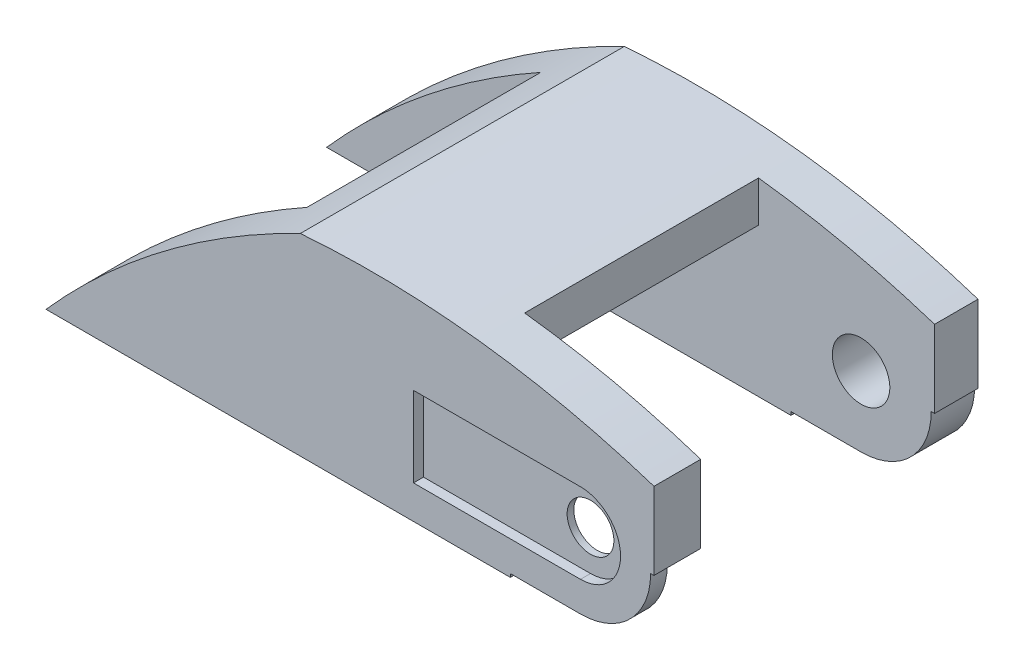
ISO-10303-21;
HEADER;
FILE_DESCRIPTION(('STEP AP214'),'2;1');
FILE_NAME('part.step','',(''),(''),'','','');
FILE_SCHEMA(('AUTOMOTIVE_DESIGN { 1 0 10303 214 1 1 1 1 }'));
ENDSEC;
DATA;
#1=APPLICATION_CONTEXT('core data for automotive mechanical design processes');
#2=APPLICATION_PROTOCOL_DEFINITION('international standard','automotive_design',2000,#1);
#3=PRODUCT_CONTEXT('',#1,'mechanical');
#4=PRODUCT('Part','Part','',(#3));
#5=PRODUCT_RELATED_PRODUCT_CATEGORY('part','',(#4));
#6=PRODUCT_DEFINITION_FORMATION('','',#4);
#7=PRODUCT_DEFINITION_CONTEXT('part definition',#1,'design');
#8=PRODUCT_DEFINITION('design','',#6,#7);
#9=PRODUCT_DEFINITION_SHAPE('','',#8);
#10=(LENGTH_UNIT() NAMED_UNIT(*) SI_UNIT(.MILLI.,.METRE.));
#11=(NAMED_UNIT(*) PLANE_ANGLE_UNIT() SI_UNIT($,.RADIAN.));
#12=(NAMED_UNIT(*) SI_UNIT($,.STERADIAN.) SOLID_ANGLE_UNIT());
#13=UNCERTAINTY_MEASURE_WITH_UNIT(LENGTH_MEASURE(1.E-05),#10,'distance_accuracy_value','');
#14=(GEOMETRIC_REPRESENTATION_CONTEXT(3) GLOBAL_UNCERTAINTY_ASSIGNED_CONTEXT((#13)) GLOBAL_UNIT_ASSIGNED_CONTEXT((#10,
#11,#12)) REPRESENTATION_CONTEXT('',''));
#15=CARTESIAN_POINT('',(0.,0.,0.));
#16=DIRECTION('',(0.,0.,1.));
#17=DIRECTION('',(1.,0.,0.));
#18=AXIS2_PLACEMENT_3D('',#15,#16,#17);
#19=CARTESIAN_POINT('',(0.,0.,-118.7));
#20=DIRECTION('',(0.,0.,1.));
#21=DIRECTION('',(-1.,0.,0.));
#22=AXIS2_PLACEMENT_3D('',#19,#20,#21);
#23=CYLINDRICAL_SURFACE('',#22,3.5);
#24=CARTESIAN_POINT('',(0.,0.,-99.5));
#25=DIRECTION('',(0.,0.,1.));
#26=DIRECTION('',(0.,-1.,0.));
#27=AXIS2_PLACEMENT_3D('',#24,#25,#26);
#28=CIRCLE('',#27,3.5);
#29=CARTESIAN_POINT('',(0.,-3.5,-99.5));
#30=VERTEX_POINT('',#29);
#31=EDGE_CURVE('E53',#30,#30,#28,.T.);
#32=ORIENTED_EDGE('',*,*,#31,.F.);
#33=EDGE_LOOP('',(#32));
#34=FACE_BOUND('',#33,.T.);
#35=CARTESIAN_POINT('',(0.,0.,-98.5));
#36=DIRECTION('',(0.,0.,-1.));
#37=DIRECTION('',(-1.,0.,0.));
#38=AXIS2_PLACEMENT_3D('',#35,#36,#37);
#39=CIRCLE('',#38,3.5);
#40=CARTESIAN_POINT('',(-3.5,0.,-98.5));
#41=VERTEX_POINT('',#40);
#42=EDGE_CURVE('E245',#41,#41,#39,.F.);
#43=ORIENTED_EDGE('',*,*,#42,.T.);
#44=EDGE_LOOP('',(#43));
#45=FACE_BOUND('',#44,.T.);
#46=ADVANCED_FACE('F49',(#34,#45),#23,.F.);
#47=CARTESIAN_POINT('',(0.,-11.,-104.));
#48=DIRECTION('',(0.,1.,0.));
#49=DIRECTION('',(-1.,0.,0.));
#50=AXIS2_PLACEMENT_3D('',#47,#48,#49);
#51=PLANE('',#50);
#52=DIRECTION('',(0.,0.,1.));
#53=VECTOR('',#52,1.);
#54=CARTESIAN_POINT('',(-10.5,-11.,-145.5));
#55=LINE('',#54,#53);
#56=CARTESIAN_POINT('',(-10.5,-11.,-145.5));
#57=VERTEX_POINT('',#56);
#58=CARTESIAN_POINT('',(-10.5,-11.,-139.));
#59=VERTEX_POINT('',#58);
#60=EDGE_CURVE('E353',#57,#59,#55,.T.);
#61=ORIENTED_EDGE('',*,*,#60,.T.);
#62=DIRECTION('',(1.,0.,0.));
#63=VECTOR('',#62,1.);
#64=CARTESIAN_POINT('',(0.,-11.,-139.));
#65=LINE('',#64,#63);
#66=CARTESIAN_POINT('',(-80.,-11.,-139.));
#67=VERTEX_POINT('',#66);
#68=EDGE_CURVE('E443',#67,#59,#65,.T.);
#69=ORIENTED_EDGE('',*,*,#68,.F.);
#70=DIRECTION('',(0.,0.,1.));
#71=VECTOR('',#70,1.);
#72=CARTESIAN_POINT('',(-80.,-11.,-104.));
#73=LINE('',#72,#71);
#74=CARTESIAN_POINT('',(-80.,-11.,-145.5));
#75=VERTEX_POINT('',#74);
#76=EDGE_CURVE('E468',#75,#67,#73,.T.);
#77=ORIENTED_EDGE('',*,*,#76,.F.);
#78=DIRECTION('',(-1.,0.,0.));
#79=VECTOR('',#78,1.);
#80=CARTESIAN_POINT('',(0.,-11.,-145.5));
#81=LINE('',#80,#79);
#82=EDGE_CURVE('E451',#57,#75,#81,.T.);
#83=ORIENTED_EDGE('',*,*,#82,.F.);
#84=EDGE_LOOP('',(#61,#69,#77,#83));
#85=FACE_BOUND('',#84,.T.);
#86=ADVANCED_FACE('F534',(#85),#51,.F.);
#87=CARTESIAN_POINT('',(12.,-12.,-104.));
#88=DIRECTION('',(0.,0.,1.));
#89=DIRECTION('',(0.,-1.,0.));
#90=AXIS2_PLACEMENT_3D('',#87,#88,#89);
#91=PLANE('',#90);
#92=CARTESIAN_POINT('',(0.,0.,-104.));
#93=DIRECTION('',(0.,0.,-1.));
#94=DIRECTION('',(0.,1.,0.));
#95=AXIS2_PLACEMENT_3D('',#92,#93,#94);
#96=CIRCLE('',#95,9.5);
#97=CARTESIAN_POINT('',(-9.5,0.,-104.));
#98=VERTEX_POINT('',#97);
#99=CARTESIAN_POINT('',(9.5,0.,-104.));
#100=VERTEX_POINT('',#99);
#101=EDGE_CURVE('E489',#98,#100,#96,.T.);
#102=ORIENTED_EDGE('',*,*,#101,.F.);
#103=DIRECTION('',(0.,1.,0.));
#104=VECTOR('',#103,1.);
#105=CARTESIAN_POINT('',(-9.5,-12.,-104.));
#106=LINE('',#105,#104);
#107=CARTESIAN_POINT('',(-9.5,-10.5,-104.));
#108=VERTEX_POINT('',#107);
#109=EDGE_CURVE('E305',#108,#98,#106,.T.);
#110=ORIENTED_EDGE('',*,*,#109,.F.);
#111=DIRECTION('',(-1.,0.,0.));
#112=VECTOR('',#111,1.);
#113=CARTESIAN_POINT('',(12.,-10.5,-104.));
#114=LINE('',#113,#112);
#115=CARTESIAN_POINT('',(-10.5,-10.5,-104.));
#116=VERTEX_POINT('',#115);
#117=EDGE_CURVE('E374',#108,#116,#114,.T.);
#118=ORIENTED_EDGE('',*,*,#117,.T.);
#119=DIRECTION('',(0.,-1.,0.));
#120=VECTOR('',#119,1.);
#121=CARTESIAN_POINT('',(-10.5,-12.,-104.));
#122=LINE('',#121,#120);
#123=CARTESIAN_POINT('',(-10.5,-11.,-104.));
#124=VERTEX_POINT('',#123);
#125=EDGE_CURVE('E362',#116,#124,#122,.T.);
#126=ORIENTED_EDGE('',*,*,#125,.T.);
#127=DIRECTION('',(-1.,0.,0.));
#128=VECTOR('',#127,1.);
#129=CARTESIAN_POINT('',(0.,-11.,-104.));
#130=LINE('',#129,#128);
#131=CARTESIAN_POINT('',(-80.,-11.,-104.));
#132=VERTEX_POINT('',#131);
#133=EDGE_CURVE('E456',#124,#132,#130,.T.);
#134=ORIENTED_EDGE('',*,*,#133,.T.);
#135=CARTESIAN_POINT('',(11.,-91.4878048780488,-104.));
#136=DIRECTION('',(0.,0.,-1.));
#137=DIRECTION('',(-1.,0.,0.));
#138=AXIS2_PLACEMENT_3D('',#135,#136,#137);
#139=CIRCLE('',#138,121.487804878049);
#140=CARTESIAN_POINT('',(-47.9438251540047,14.7426625515026,-104.));
#141=VERTEX_POINT('',#140);
#142=EDGE_CURVE('E398',#132,#141,#139,.T.);
#143=ORIENTED_EDGE('',*,*,#142,.T.);
#144=DIRECTION('',(0.,-1.,0.));
#145=VECTOR('',#144,1.);
#146=CARTESIAN_POINT('',(-47.9438251540047,23.2476872678202,-104.));
#147=LINE('',#146,#145);
#148=CARTESIAN_POINT('',(-47.9438251540047,10.8212370318415,-104.));
#149=VERTEX_POINT('',#148);
#150=EDGE_CURVE('E378',#141,#149,#147,.T.);
#151=ORIENTED_EDGE('',*,*,#150,.T.);
#152=DIRECTION('',(-0.999921466953452,-0.0125323551520775,0.));
#153=VECTOR('',#152,1.);
#154=CARTESIAN_POINT('',(11.7046038405384,11.5688310390996,-104.));
#155=LINE('',#154,#153);
#156=CARTESIAN_POINT('',(-15.3528796517891,11.2297104142764,-104.));
#157=VERTEX_POINT('',#156);
#158=EDGE_CURVE('E420',#157,#149,#155,.T.);
#159=ORIENTED_EDGE('',*,*,#158,.F.);
#160=DIRECTION('',(0.,1.,0.));
#161=VECTOR('',#160,1.);
#162=CARTESIAN_POINT('',(-15.3528796517891,27.0048203954215,-104.));
#163=LINE('',#162,#161);
#164=CARTESIAN_POINT('',(-15.3528796517891,17.3490527668032,-104.));
#165=VERTEX_POINT('',#164);
#166=EDGE_CURVE('E383',#157,#165,#163,.T.);
#167=ORIENTED_EDGE('',*,*,#166,.T.);
#168=CARTESIAN_POINT('',(-31.2492235347199,-117.890366828592,-104.));
#169=DIRECTION('',(0.,0.,-1.));
#170=DIRECTION('',(-1.,0.,0.));
#171=AXIS2_PLACEMENT_3D('',#168,#169,#170);
#172=CIRCLE('',#171,136.170460678312);
#173=CARTESIAN_POINT('',(11.,11.56,-104.));
#174=VERTEX_POINT('',#173);
#175=EDGE_CURVE('E409',#174,#165,#172,.F.);
#176=ORIENTED_EDGE('',*,*,#175,.F.);
#177=DIRECTION('',(0.,-1.,0.));
#178=VECTOR('',#177,1.);
#179=CARTESIAN_POINT('',(11.,-12.,-104.));
#180=LINE('',#179,#178);
#181=CARTESIAN_POINT('',(11.,0.,-104.));
#182=VERTEX_POINT('',#181);
#183=EDGE_CURVE('E484',#174,#182,#180,.T.);
#184=ORIENTED_EDGE('',*,*,#183,.T.);
#185=DIRECTION('',(-1.,0.,0.));
#186=VECTOR('',#185,1.);
#187=CARTESIAN_POINT('',(12.,0.,-104.));
#188=LINE('',#187,#186);
#189=EDGE_CURVE('E370',#182,#100,#188,.T.);
#190=ORIENTED_EDGE('',*,*,#189,.T.);
#191=EDGE_LOOP('',(#102,#110,#118,#126,#134,#143,#151,#159,#167,#176,#184,#190));
#192=FACE_BOUND('',#191,.T.);
#193=ADVANCED_FACE('F570',(#192),#91,.F.);
#194=CARTESIAN_POINT('',(0.,0.,-97.));
#195=DIRECTION('',(0.,0.,1.));
#196=DIRECTION('',(1.,0.,0.));
#197=AXIS2_PLACEMENT_3D('',#194,#195,#196);
#198=PLANE('',#197);
#199=CARTESIAN_POINT('',(0.,0.,-97.));
#200=DIRECTION('',(0.,0.,-1.));
#201=DIRECTION('',(-1.,0.,0.));
#202=AXIS2_PLACEMENT_3D('',#199,#200,#201);
#203=CIRCLE('',#202,6.);
#204=CARTESIAN_POINT('',(0.,6.,-97.));
#205=VERTEX_POINT('',#204);
#206=CARTESIAN_POINT('',(0.,-6.,-97.));
#207=VERTEX_POINT('',#206);
#208=EDGE_CURVE('E265',#205,#207,#203,.T.);
#209=ORIENTED_EDGE('',*,*,#208,.T.);
#210=DIRECTION('',(-1.,0.,0.));
#211=VECTOR('',#210,1.);
#212=CARTESIAN_POINT('',(0.,-6.,-97.));
#213=LINE('',#212,#211);
#214=CARTESIAN_POINT('',(-25.,-6.,-97.));
#215=VERTEX_POINT('',#214);
#216=EDGE_CURVE('E241',#207,#215,#213,.T.);
#217=ORIENTED_EDGE('',*,*,#216,.T.);
#218=DIRECTION('',(0.,-1.,0.));
#219=VECTOR('',#218,1.);
#220=CARTESIAN_POINT('',(-25.,0.,-97.));
#221=LINE('',#220,#219);
#222=CARTESIAN_POINT('',(-25.,6.,-97.));
#223=VERTEX_POINT('',#222);
#224=EDGE_CURVE('E254',#223,#215,#221,.T.);
#225=ORIENTED_EDGE('',*,*,#224,.F.);
#226=DIRECTION('',(-1.,0.,0.));
#227=VECTOR('',#226,1.);
#228=CARTESIAN_POINT('',(0.,6.,-97.));
#229=LINE('',#228,#227);
#230=EDGE_CURVE('E250',#205,#223,#229,.T.);
#231=ORIENTED_EDGE('',*,*,#230,.F.);
#232=EDGE_LOOP('',(#209,#217,#225,#231));
#233=FACE_BOUND('',#232,.T.);
#234=DIRECTION('',(-1.,0.,0.));
#235=VECTOR('',#234,1.);
#236=CARTESIAN_POINT('',(0.,-10.5,-97.));
#237=LINE('',#236,#235);
#238=CARTESIAN_POINT('',(0.,-10.5,-97.));
#239=VERTEX_POINT('',#238);
#240=CARTESIAN_POINT('',(-10.5,-10.5,-97.));
#241=VERTEX_POINT('',#240);
#242=EDGE_CURVE('E319',#239,#241,#237,.T.);
#243=ORIENTED_EDGE('',*,*,#242,.F.);
#244=CARTESIAN_POINT('',(0.,0.,-97.));
#245=DIRECTION('',(0.,0.,-1.));
#246=DIRECTION('',(-1.,0.,0.));
#247=AXIS2_PLACEMENT_3D('',#244,#245,#246);
#248=CIRCLE('',#247,10.5);
#249=CARTESIAN_POINT('',(10.5,0.,-97.));
#250=VERTEX_POINT('',#249);
#251=EDGE_CURVE('E331',#250,#239,#248,.T.);
#252=ORIENTED_EDGE('',*,*,#251,.F.);
#253=DIRECTION('',(-1.,0.,0.));
#254=VECTOR('',#253,1.);
#255=CARTESIAN_POINT('',(0.,0.,-97.));
#256=LINE('',#255,#254);
#257=CARTESIAN_POINT('',(11.,0.,-97.));
#258=VERTEX_POINT('',#257);
#259=EDGE_CURVE('E334',#258,#250,#256,.T.);
#260=ORIENTED_EDGE('',*,*,#259,.F.);
#261=DIRECTION('',(0.,-1.,0.));
#262=VECTOR('',#261,1.);
#263=CARTESIAN_POINT('',(11.,0.,-97.));
#264=LINE('',#263,#262);
#265=CARTESIAN_POINT('',(11.,11.56,-97.));
#266=VERTEX_POINT('',#265);
#267=EDGE_CURVE('E472',#266,#258,#264,.T.);
#268=ORIENTED_EDGE('',*,*,#267,.F.);
#269=CARTESIAN_POINT('',(-31.2492235347199,-117.890366828592,-97.));
#270=DIRECTION('',(0.,0.,1.));
#271=DIRECTION('',(1.,0.,0.));
#272=AXIS2_PLACEMENT_3D('',#269,#270,#271);
#273=CIRCLE('',#272,136.170460678312);
#274=CARTESIAN_POINT('',(-41.9371731625238,17.86,-97.));
#275=VERTEX_POINT('',#274);
#276=EDGE_CURVE('E425',#266,#275,#273,.T.);
#277=ORIENTED_EDGE('',*,*,#276,.T.);
#278=CARTESIAN_POINT('',(11.,-91.4878048780488,-97.));
#279=DIRECTION('',(0.,0.,1.));
#280=DIRECTION('',(1.,0.,0.));
#281=AXIS2_PLACEMENT_3D('',#278,#279,#280);
#282=CIRCLE('',#281,121.487804878049);
#283=CARTESIAN_POINT('',(-80.,-11.,-97.));
#284=VERTEX_POINT('',#283);
#285=EDGE_CURVE('E455',#284,#275,#282,.F.);
#286=ORIENTED_EDGE('',*,*,#285,.F.);
#287=DIRECTION('',(-1.,0.,0.));
#288=VECTOR('',#287,1.);
#289=CARTESIAN_POINT('',(0.,-11.,-97.));
#290=LINE('',#289,#288);
#291=CARTESIAN_POINT('',(-10.5,-11.,-97.));
#292=VERTEX_POINT('',#291);
#293=EDGE_CURVE('E461',#292,#284,#290,.T.);
#294=ORIENTED_EDGE('',*,*,#293,.F.);
#295=DIRECTION('',(0.,-1.,0.));
#296=VECTOR('',#295,1.);
#297=CARTESIAN_POINT('',(-10.5,0.,-97.));
#298=LINE('',#297,#296);
#299=EDGE_CURVE('E338',#241,#292,#298,.T.);
#300=ORIENTED_EDGE('',*,*,#299,.F.);
#301=EDGE_LOOP('',(#243,#252,#260,#268,#277,#286,#294,#300));
#302=FACE_BOUND('',#301,.T.);
#303=ADVANCED_FACE('F525',(#233,#302),#198,.T.);
#304=CARTESIAN_POINT('',(0.,0.,-145.5));
#305=DIRECTION('',(0.,0.,-1.));
#306=DIRECTION('',(-1.,0.,0.));
#307=AXIS2_PLACEMENT_3D('',#304,#305,#306);
#308=PLANE('',#307);
#309=CARTESIAN_POINT('',(0.,0.,-145.5));
#310=DIRECTION('',(0.,0.,-1.));
#311=DIRECTION('',(-1.,0.,0.));
#312=AXIS2_PLACEMENT_3D('',#309,#310,#311);
#313=CIRCLE('',#312,4.3);
#314=CARTESIAN_POINT('',(-4.3,0.,-145.5));
#315=VERTEX_POINT('',#314);
#316=EDGE_CURVE('E309',#315,#315,#313,.T.);
#317=ORIENTED_EDGE('',*,*,#316,.F.);
#318=EDGE_LOOP('',(#317));
#319=FACE_BOUND('',#318,.T.);
#320=ORIENTED_EDGE('',*,*,#82,.T.);
#321=CARTESIAN_POINT('',(11.,-91.4878048780488,-145.5));
#322=DIRECTION('',(0.,0.,1.));
#323=DIRECTION('',(1.,0.,0.));
#324=AXIS2_PLACEMENT_3D('',#321,#322,#323);
#325=CIRCLE('',#324,121.487804878049);
#326=CARTESIAN_POINT('',(-41.9371731625238,17.86,-145.5));
#327=VERTEX_POINT('',#326);
#328=EDGE_CURVE('E447',#75,#327,#325,.F.);
#329=ORIENTED_EDGE('',*,*,#328,.T.);
#330=CARTESIAN_POINT('',(-31.2492235347199,-117.890366828592,-145.5));
#331=DIRECTION('',(0.,0.,1.));
#332=DIRECTION('',(1.,0.,0.));
#333=AXIS2_PLACEMENT_3D('',#330,#331,#332);
#334=CIRCLE('',#333,136.170460678312);
#335=CARTESIAN_POINT('',(11.,11.56,-145.5));
#336=VERTEX_POINT('',#335);
#337=EDGE_CURVE('E424',#336,#327,#334,.T.);
#338=ORIENTED_EDGE('',*,*,#337,.F.);
#339=DIRECTION('',(0.,-1.,0.));
#340=VECTOR('',#339,1.);
#341=CARTESIAN_POINT('',(11.,0.,-145.5));
#342=LINE('',#341,#340);
#343=CARTESIAN_POINT('',(11.,0.,-145.5));
#344=VERTEX_POINT('',#343);
#345=EDGE_CURVE('E473',#336,#344,#342,.T.);
#346=ORIENTED_EDGE('',*,*,#345,.T.);
#347=DIRECTION('',(-1.,0.,0.));
#348=VECTOR('',#347,1.);
#349=CARTESIAN_POINT('',(0.,0.,-145.5));
#350=LINE('',#349,#348);
#351=CARTESIAN_POINT('',(10.5,0.,-145.5));
#352=VERTEX_POINT('',#351);
#353=EDGE_CURVE('E318',#344,#352,#350,.T.);
#354=ORIENTED_EDGE('',*,*,#353,.T.);
#355=CARTESIAN_POINT('',(0.,0.,-145.5));
#356=DIRECTION('',(0.,0.,-1.));
#357=DIRECTION('',(-1.,0.,0.));
#358=AXIS2_PLACEMENT_3D('',#355,#356,#357);
#359=CIRCLE('',#358,10.5);
#360=CARTESIAN_POINT('',(0.,-10.5,-145.5));
#361=VERTEX_POINT('',#360);
#362=EDGE_CURVE('E314',#352,#361,#359,.T.);
#363=ORIENTED_EDGE('',*,*,#362,.T.);
#364=DIRECTION('',(-1.,0.,0.));
#365=VECTOR('',#364,1.);
#366=CARTESIAN_POINT('',(0.,-10.5,-145.5));
#367=LINE('',#366,#365);
#368=CARTESIAN_POINT('',(-10.5,-10.5,-145.5));
#369=VERTEX_POINT('',#368);
#370=EDGE_CURVE('E326',#361,#369,#367,.T.);
#371=ORIENTED_EDGE('',*,*,#370,.T.);
#372=DIRECTION('',(0.,-1.,0.));
#373=VECTOR('',#372,1.);
#374=CARTESIAN_POINT('',(-10.5,0.,-145.5));
#375=LINE('',#374,#373);
#376=EDGE_CURVE('E323',#369,#57,#375,.T.);
#377=ORIENTED_EDGE('',*,*,#376,.T.);
#378=EDGE_LOOP('',(#320,#329,#338,#346,#354,#363,#371,#377));
#379=FACE_BOUND('',#378,.T.);
#380=ADVANCED_FACE('F522',(#319,#379),#308,.T.);
#381=CARTESIAN_POINT('',(0.,0.,-139.));
#382=DIRECTION('',(0.,0.,1.));
#383=DIRECTION('',(1.,0.,0.));
#384=AXIS2_PLACEMENT_3D('',#381,#382,#383);
#385=PLANE('',#384);
#386=CARTESIAN_POINT('',(0.,0.,-139.));
#387=DIRECTION('',(0.,0.,-1.));
#388=DIRECTION('',(-1.,0.,0.));
#389=AXIS2_PLACEMENT_3D('',#386,#387,#388);
#390=CIRCLE('',#389,4.3);
#391=CARTESIAN_POINT('',(-4.3,0.,-139.));
#392=VERTEX_POINT('',#391);
#393=EDGE_CURVE('E313',#392,#392,#390,.T.);
#394=ORIENTED_EDGE('',*,*,#393,.T.);
#395=EDGE_LOOP('',(#394));
#396=FACE_BOUND('',#395,.T.);
#397=DIRECTION('',(-1.,0.,0.));
#398=VECTOR('',#397,1.);
#399=CARTESIAN_POINT('',(0.,-10.5,-139.));
#400=LINE('',#399,#398);
#401=CARTESIAN_POINT('',(0.,-10.5,-139.));
#402=VERTEX_POINT('',#401);
#403=CARTESIAN_POINT('',(-10.5,-10.5,-139.));
#404=VERTEX_POINT('',#403);
#405=EDGE_CURVE('E11',#402,#404,#400,.T.);
#406=ORIENTED_EDGE('',*,*,#405,.F.);
#407=CARTESIAN_POINT('',(0.,0.,-139.));
#408=DIRECTION('',(0.,0.,-1.));
#409=DIRECTION('',(-1.,0.,0.));
#410=AXIS2_PLACEMENT_3D('',#407,#408,#409);
#411=CIRCLE('',#410,10.5);
#412=CARTESIAN_POINT('',(10.5,0.,-139.));
#413=VERTEX_POINT('',#412);
#414=EDGE_CURVE('E59',#413,#402,#411,.T.);
#415=ORIENTED_EDGE('',*,*,#414,.F.);
#416=DIRECTION('',(-1.,0.,0.));
#417=VECTOR('',#416,1.);
#418=CARTESIAN_POINT('',(0.,0.,-139.));
#419=LINE('',#418,#417);
#420=CARTESIAN_POINT('',(11.,0.,-139.));
#421=VERTEX_POINT('',#420);
#422=EDGE_CURVE('E366',#421,#413,#419,.T.);
#423=ORIENTED_EDGE('',*,*,#422,.F.);
#424=DIRECTION('',(0.,1.,0.));
#425=VECTOR('',#424,1.);
#426=CARTESIAN_POINT('',(11.,0.,-139.));
#427=LINE('',#426,#425);
#428=CARTESIAN_POINT('',(11.,11.56,-139.));
#429=VERTEX_POINT('',#428);
#430=EDGE_CURVE('E436',#421,#429,#427,.T.);
#431=ORIENTED_EDGE('',*,*,#430,.T.);
#432=CARTESIAN_POINT('',(-31.2492235347199,-117.890366828592,-139.));
#433=DIRECTION('',(0.,0.,-1.));
#434=DIRECTION('',(-1.,0.,0.));
#435=AXIS2_PLACEMENT_3D('',#432,#433,#434);
#436=CIRCLE('',#435,136.170460678312);
#437=CARTESIAN_POINT('',(-15.3528796517891,17.3490527668032,-139.));
#438=VERTEX_POINT('',#437);
#439=EDGE_CURVE('E405',#429,#438,#436,.F.);
#440=ORIENTED_EDGE('',*,*,#439,.T.);
#441=DIRECTION('',(0.,1.,0.));
#442=VECTOR('',#441,1.);
#443=CARTESIAN_POINT('',(-15.3528796517891,27.0048203954215,-139.));
#444=LINE('',#443,#442);
#445=CARTESIAN_POINT('',(-15.3528796517891,11.2297104142764,-139.));
#446=VERTEX_POINT('',#445);
#447=EDGE_CURVE('E379',#446,#438,#444,.T.);
#448=ORIENTED_EDGE('',*,*,#447,.F.);
#449=DIRECTION('',(-0.999921466953452,-0.0125323551520775,0.));
#450=VECTOR('',#449,1.);
#451=CARTESIAN_POINT('',(-0.143134988977188,11.4203393068309,-139.));
#452=LINE('',#451,#450);
#453=CARTESIAN_POINT('',(-47.9438251540047,10.8212370318415,-139.));
#454=VERTEX_POINT('',#453);
#455=EDGE_CURVE('E416',#446,#454,#452,.T.);
#456=ORIENTED_EDGE('',*,*,#455,.T.);
#457=DIRECTION('',(0.,-1.,0.));
#458=VECTOR('',#457,1.);
#459=CARTESIAN_POINT('',(-47.9438251540047,23.2476872678202,-139.));
#460=LINE('',#459,#458);
#461=CARTESIAN_POINT('',(-47.9438251540047,14.7426625515026,-139.));
#462=VERTEX_POINT('',#461);
#463=EDGE_CURVE('E384',#462,#454,#460,.T.);
#464=ORIENTED_EDGE('',*,*,#463,.F.);
#465=CARTESIAN_POINT('',(11.,-91.4878048780488,-139.));
#466=DIRECTION('',(0.,0.,-1.));
#467=DIRECTION('',(-1.,0.,0.));
#468=AXIS2_PLACEMENT_3D('',#465,#466,#467);
#469=CIRCLE('',#468,121.487804878049);
#470=EDGE_CURVE('E388',#67,#462,#469,.T.);
#471=ORIENTED_EDGE('',*,*,#470,.F.);
#472=ORIENTED_EDGE('',*,*,#68,.T.);
#473=DIRECTION('',(0.,-1.,0.));
#474=VECTOR('',#473,1.);
#475=CARTESIAN_POINT('',(-10.5,0.,-139.));
#476=LINE('',#475,#474);
#477=EDGE_CURVE('E348',#404,#59,#476,.T.);
#478=ORIENTED_EDGE('',*,*,#477,.F.);
#479=EDGE_LOOP('',(#406,#415,#423,#431,#440,#448,#456,#464,#471,#472,#478));
#480=FACE_BOUND('',#479,.T.);
#481=ADVANCED_FACE('F511',(#396,#480),#385,.T.);
#482=DIRECTION('',(0.,0.,1.));
#483=VECTOR('',#482,1.);
#484=CARTESIAN_POINT('',(-10.5,-11.,-104.));
#485=LINE('',#484,#483);
#486=EDGE_CURVE('E502',#124,#292,#485,.T.);
#487=ORIENTED_EDGE('',*,*,#486,.T.);
#488=ORIENTED_EDGE('',*,*,#293,.T.);
#489=EDGE_CURVE('E460',#132,#284,#73,.T.);
#490=ORIENTED_EDGE('',*,*,#489,.F.);
#491=ORIENTED_EDGE('',*,*,#133,.F.);
#492=EDGE_LOOP('',(#487,#488,#490,#491));
#493=FACE_BOUND('',#492,.T.);
#494=ADVANCED_FACE('F573',(#493),#51,.F.);
#495=CARTESIAN_POINT('',(-0.143134988977188,11.4203393068309,-141.25));
#496=DIRECTION('',(0.0125323551520775,-0.999921466953451,0.));
#497=DIRECTION('',(0.999921466953452,0.0125323551520775,0.));
#498=AXIS2_PLACEMENT_3D('',#495,#496,#497);
#499=PLANE('',#498);
#500=ORIENTED_EDGE('',*,*,#158,.T.);
#501=DIRECTION('',(0.,0.,1.));
#502=VECTOR('',#501,1.);
#503=CARTESIAN_POINT('',(-47.9438251540047,10.8212370318415,-141.25));
#504=LINE('',#503,#502);
#505=EDGE_CURVE('E493',#454,#149,#504,.T.);
#506=ORIENTED_EDGE('',*,*,#505,.F.);
#507=ORIENTED_EDGE('',*,*,#455,.F.);
#508=DIRECTION('',(0.,0.,-1.));
#509=VECTOR('',#508,1.);
#510=CARTESIAN_POINT('',(-15.3528796517891,11.2297104142764,-141.25));
#511=LINE('',#510,#509);
#512=EDGE_CURVE('E499',#157,#446,#511,.T.);
#513=ORIENTED_EDGE('',*,*,#512,.F.);
#514=EDGE_LOOP('',(#500,#506,#507,#513));
#515=FACE_BOUND('',#514,.T.);
#516=ADVANCED_FACE('F787',(#515),#499,.T.);
#517=CARTESIAN_POINT('',(11.,0.,-145.5));
#518=DIRECTION('',(-1.,0.,0.));
#519=DIRECTION('',(0.,0.,1.));
#520=AXIS2_PLACEMENT_3D('',#517,#518,#519);
#521=PLANE('',#520);
#522=DIRECTION('',(0.,0.,-1.));
#523=VECTOR('',#522,1.);
#524=CARTESIAN_POINT('',(11.,11.56,-97.));
#525=LINE('',#524,#523);
#526=EDGE_CURVE('E429',#429,#336,#525,.T.);
#527=ORIENTED_EDGE('',*,*,#526,.F.);
#528=ORIENTED_EDGE('',*,*,#430,.F.);
#529=DIRECTION('',(0.,0.,1.));
#530=VECTOR('',#529,1.);
#531=CARTESIAN_POINT('',(11.,0.,-145.5));
#532=LINE('',#531,#530);
#533=EDGE_CURVE('E481',#344,#421,#532,.T.);
#534=ORIENTED_EDGE('',*,*,#533,.F.);
#535=ORIENTED_EDGE('',*,*,#345,.F.);
#536=EDGE_LOOP('',(#527,#528,#534,#535));
#537=FACE_BOUND('',#536,.T.);
#538=ADVANCED_FACE('F546',(#537),#521,.F.);
#539=EDGE_CURVE('E437',#266,#174,#525,.T.);
#540=ORIENTED_EDGE('',*,*,#539,.F.);
#541=ORIENTED_EDGE('',*,*,#267,.T.);
#542=EDGE_CURVE('E477',#182,#258,#532,.T.);
#543=ORIENTED_EDGE('',*,*,#542,.F.);
#544=ORIENTED_EDGE('',*,*,#183,.F.);
#545=EDGE_LOOP('',(#540,#541,#543,#544));
#546=FACE_BOUND('',#545,.T.);
#547=ADVANCED_FACE('F769',(#546),#521,.F.);
#548=CARTESIAN_POINT('',(11.,-91.4878048780488,-104.));
#549=DIRECTION('',(0.,0.,1.));
#550=DIRECTION('',(1.,0.,0.));
#551=AXIS2_PLACEMENT_3D('',#548,#549,#550);
#552=CYLINDRICAL_SURFACE('',#551,121.487804878049);
#553=ORIENTED_EDGE('',*,*,#489,.T.);
#554=ORIENTED_EDGE('',*,*,#285,.T.);
#555=DIRECTION('',(0.,0.,-1.));
#556=VECTOR('',#555,1.);
#557=CARTESIAN_POINT('',(-41.9371731625238,17.86,-97.));
#558=LINE('',#557,#556);
#559=EDGE_CURVE('E433',#275,#327,#558,.T.);
#560=ORIENTED_EDGE('',*,*,#559,.T.);
#561=ORIENTED_EDGE('',*,*,#328,.F.);
#562=ORIENTED_EDGE('',*,*,#76,.T.);
#563=ORIENTED_EDGE('',*,*,#470,.T.);
#564=DIRECTION('',(0.,0.,1.));
#565=VECTOR('',#564,1.);
#566=CARTESIAN_POINT('',(-47.9438251540047,14.7426625515026,-104.));
#567=LINE('',#566,#565);
#568=EDGE_CURVE('E402',#462,#141,#567,.T.);
#569=ORIENTED_EDGE('',*,*,#568,.T.);
#570=ORIENTED_EDGE('',*,*,#142,.F.);
#571=EDGE_LOOP('',(#553,#554,#560,#561,#562,#563,#569,#570));
#572=FACE_BOUND('',#571,.T.);
#573=ADVANCED_FACE('F536',(#572),#552,.T.);
#574=CARTESIAN_POINT('',(0.,0.,-99.5));
#575=DIRECTION('',(0.,0.,-1.));
#576=DIRECTION('',(0.,1.,0.));
#577=AXIS2_PLACEMENT_3D('',#574,#575,#576);
#578=PLANE('',#577);
#579=ORIENTED_EDGE('',*,*,#31,.T.);
#580=EDGE_LOOP('',(#579));
#581=FACE_BOUND('',#580,.T.);
#582=CARTESIAN_POINT('',(0.,0.,-99.5));
#583=DIRECTION('',(0.,0.,-1.));
#584=DIRECTION('',(0.,1.,0.));
#585=AXIS2_PLACEMENT_3D('',#582,#583,#584);
#586=CIRCLE('',#585,9.5);
#587=CARTESIAN_POINT('',(-9.5,0.,-99.5));
#588=VERTEX_POINT('',#587);
#589=CARTESIAN_POINT('',(9.5,0.,-99.5));
#590=VERTEX_POINT('',#589);
#591=EDGE_CURVE('E488',#588,#590,#586,.T.);
#592=ORIENTED_EDGE('',*,*,#591,.T.);
#593=DIRECTION('',(-1.,0.,0.));
#594=VECTOR('',#593,1.);
#595=CARTESIAN_POINT('',(0.,0.,-99.5));
#596=LINE('',#595,#594);
#597=CARTESIAN_POINT('',(10.5,0.,-99.5));
#598=VERTEX_POINT('',#597);
#599=EDGE_CURVE('E280',#598,#590,#596,.T.);
#600=ORIENTED_EDGE('',*,*,#599,.F.);
#601=CARTESIAN_POINT('',(0.,0.,-99.5));
#602=DIRECTION('',(0.,0.,-1.));
#603=DIRECTION('',(-1.,0.,0.));
#604=AXIS2_PLACEMENT_3D('',#601,#602,#603);
#605=CIRCLE('',#604,10.5);
#606=CARTESIAN_POINT('',(0.,-10.5,-99.5));
#607=VERTEX_POINT('',#606);
#608=EDGE_CURVE('E284',#598,#607,#605,.T.);
#609=ORIENTED_EDGE('',*,*,#608,.T.);
#610=DIRECTION('',(-1.,0.,0.));
#611=VECTOR('',#610,1.);
#612=CARTESIAN_POINT('',(0.,-10.5,-99.5));
#613=LINE('',#612,#611);
#614=CARTESIAN_POINT('',(-9.5,-10.5,-99.5));
#615=VERTEX_POINT('',#614);
#616=EDGE_CURVE('E288',#607,#615,#613,.T.);
#617=ORIENTED_EDGE('',*,*,#616,.T.);
#618=DIRECTION('',(0.,-1.,0.));
#619=VECTOR('',#618,1.);
#620=CARTESIAN_POINT('',(-9.5,0.,-99.5));
#621=LINE('',#620,#619);
#622=EDGE_CURVE('E292',#588,#615,#621,.T.);
#623=ORIENTED_EDGE('',*,*,#622,.F.);
#624=EDGE_LOOP('',(#592,#600,#609,#617,#623));
#625=FACE_BOUND('',#624,.T.);
#626=ADVANCED_FACE('F51',(#581,#625),#578,.T.);
#627=CARTESIAN_POINT('',(0.,0.,-99.5));
#628=DIRECTION('',(0.,0.,-1.));
#629=DIRECTION('',(0.,1.,0.));
#630=AXIS2_PLACEMENT_3D('',#627,#628,#629);
#631=CYLINDRICAL_SURFACE('',#630,9.5);
#632=ORIENTED_EDGE('',*,*,#591,.F.);
#633=DIRECTION('',(0.,0.,-1.));
#634=VECTOR('',#633,1.);
#635=CARTESIAN_POINT('',(-9.5,0.,-99.5));
#636=LINE('',#635,#634);
#637=EDGE_CURVE('E299',#588,#98,#636,.T.);
#638=ORIENTED_EDGE('',*,*,#637,.T.);
#639=ORIENTED_EDGE('',*,*,#101,.T.);
#640=DIRECTION('',(0.,0.,-1.));
#641=VECTOR('',#640,1.);
#642=CARTESIAN_POINT('',(9.5,0.,-99.5));
#643=LINE('',#642,#641);
#644=EDGE_CURVE('E296',#590,#100,#643,.T.);
#645=ORIENTED_EDGE('',*,*,#644,.F.);
#646=EDGE_LOOP('',(#632,#638,#639,#645));
#647=FACE_BOUND('',#646,.T.);
#648=ADVANCED_FACE('F601',(#647),#631,.F.);
#649=CARTESIAN_POINT('',(-31.2492235347199,-117.890366828592,-97.));
#650=DIRECTION('',(0.,0.,-1.));
#651=DIRECTION('',(1.,0.,0.));
#652=AXIS2_PLACEMENT_3D('',#649,#650,#651);
#653=CYLINDRICAL_SURFACE('',#652,136.170460678312);
#654=ORIENTED_EDGE('',*,*,#175,.T.);
#655=DIRECTION('',(0.,0.,-1.));
#656=VECTOR('',#655,1.);
#657=CARTESIAN_POINT('',(-15.3528796517891,17.3490527668032,-97.));
#658=LINE('',#657,#656);
#659=EDGE_CURVE('E413',#438,#165,#658,.F.);
#660=ORIENTED_EDGE('',*,*,#659,.F.);
#661=ORIENTED_EDGE('',*,*,#439,.F.);
#662=ORIENTED_EDGE('',*,*,#526,.T.);
#663=ORIENTED_EDGE('',*,*,#337,.T.);
#664=ORIENTED_EDGE('',*,*,#559,.F.);
#665=ORIENTED_EDGE('',*,*,#276,.F.);
#666=ORIENTED_EDGE('',*,*,#539,.T.);
#667=EDGE_LOOP('',(#654,#660,#661,#662,#663,#664,#665,#666));
#668=FACE_BOUND('',#667,.T.);
#669=ADVANCED_FACE('F541',(#668),#653,.T.);
#670=CARTESIAN_POINT('',(-47.9438251540047,23.2476872678202,-104.));
#671=DIRECTION('',(-1.,0.,0.));
#672=DIRECTION('',(0.,0.,-1.));
#673=AXIS2_PLACEMENT_3D('',#670,#671,#672);
#674=PLANE('',#673);
#675=ORIENTED_EDGE('',*,*,#568,.F.);
#676=ORIENTED_EDGE('',*,*,#463,.T.);
#677=ORIENTED_EDGE('',*,*,#505,.T.);
#678=ORIENTED_EDGE('',*,*,#150,.F.);
#679=EDGE_LOOP('',(#675,#676,#677,#678));
#680=FACE_BOUND('',#679,.T.);
#681=ADVANCED_FACE('F564',(#680),#674,.T.);
#682=CARTESIAN_POINT('',(-15.3528796517891,27.0048203954215,-104.));
#683=DIRECTION('',(1.,0.,0.));
#684=DIRECTION('',(0.,0.,1.));
#685=AXIS2_PLACEMENT_3D('',#682,#683,#684);
#686=PLANE('',#685);
#687=ORIENTED_EDGE('',*,*,#447,.T.);
#688=ORIENTED_EDGE('',*,*,#659,.T.);
#689=ORIENTED_EDGE('',*,*,#166,.F.);
#690=ORIENTED_EDGE('',*,*,#512,.T.);
#691=EDGE_LOOP('',(#687,#688,#689,#690));
#692=FACE_BOUND('',#691,.T.);
#693=ADVANCED_FACE('F726',(#692),#686,.T.);
#694=CARTESIAN_POINT('',(-10.5,0.,-145.5));
#695=DIRECTION('',(1.,0.,0.));
#696=DIRECTION('',(0.,0.,1.));
#697=AXIS2_PLACEMENT_3D('',#694,#695,#696);
#698=PLANE('',#697);
#699=ORIENTED_EDGE('',*,*,#125,.F.);
#700=DIRECTION('',(0.,0.,1.));
#701=VECTOR('',#700,1.);
#702=CARTESIAN_POINT('',(-10.5,-10.5,-145.5));
#703=LINE('',#702,#701);
#704=EDGE_CURVE('E352',#116,#241,#703,.T.);
#705=ORIENTED_EDGE('',*,*,#704,.T.);
#706=ORIENTED_EDGE('',*,*,#299,.T.);
#707=ORIENTED_EDGE('',*,*,#486,.F.);
#708=EDGE_LOOP('',(#699,#705,#706,#707));
#709=FACE_BOUND('',#708,.T.);
#710=ADVANCED_FACE('F686',(#709),#698,.T.);
#711=CARTESIAN_POINT('',(0.,-10.5,-145.5));
#712=DIRECTION('',(0.,-1.,0.));
#713=DIRECTION('',(0.,0.,1.));
#714=AXIS2_PLACEMENT_3D('',#711,#712,#713);
#715=PLANE('',#714);
#716=DIRECTION('',(0.,0.,-1.));
#717=VECTOR('',#716,1.);
#718=CARTESIAN_POINT('',(-9.5,-10.5,-99.5));
#719=LINE('',#718,#717);
#720=EDGE_CURVE('E302',#615,#108,#719,.T.);
#721=ORIENTED_EDGE('',*,*,#720,.F.);
#722=ORIENTED_EDGE('',*,*,#616,.F.);
#723=DIRECTION('',(0.,0.,1.));
#724=VECTOR('',#723,1.);
#725=CARTESIAN_POINT('',(0.,-10.5,-145.5));
#726=LINE('',#725,#724);
#727=EDGE_CURVE('E75',#607,#239,#726,.T.);
#728=ORIENTED_EDGE('',*,*,#727,.T.);
#729=ORIENTED_EDGE('',*,*,#242,.T.);
#730=ORIENTED_EDGE('',*,*,#704,.F.);
#731=ORIENTED_EDGE('',*,*,#117,.F.);
#732=EDGE_LOOP('',(#721,#722,#728,#729,#730,#731));
#733=FACE_BOUND('',#732,.T.);
#734=ADVANCED_FACE('F592',(#733),#715,.T.);
#735=CARTESIAN_POINT('',(0.,0.,-145.5));
#736=DIRECTION('',(0.,-1.,0.));
#737=DIRECTION('',(1.,0.,0.));
#738=AXIS2_PLACEMENT_3D('',#735,#736,#737);
#739=PLANE('',#738);
#740=ORIENTED_EDGE('',*,*,#189,.F.);
#741=ORIENTED_EDGE('',*,*,#542,.T.);
#742=ORIENTED_EDGE('',*,*,#259,.T.);
#743=DIRECTION('',(0.,0.,1.));
#744=VECTOR('',#743,1.);
#745=CARTESIAN_POINT('',(10.5,0.,-145.5));
#746=LINE('',#745,#744);
#747=EDGE_CURVE('E330',#598,#250,#746,.T.);
#748=ORIENTED_EDGE('',*,*,#747,.F.);
#749=ORIENTED_EDGE('',*,*,#599,.T.);
#750=ORIENTED_EDGE('',*,*,#644,.T.);
#751=EDGE_LOOP('',(#740,#741,#742,#748,#749,#750));
#752=FACE_BOUND('',#751,.T.);
#753=ADVANCED_FACE('F587',(#752),#739,.T.);
#754=CARTESIAN_POINT('',(0.,0.,-145.5));
#755=DIRECTION('',(0.,0.,1.));
#756=DIRECTION('',(-1.,0.,0.));
#757=AXIS2_PLACEMENT_3D('',#754,#755,#756);
#758=CYLINDRICAL_SURFACE('',#757,10.5);
#759=ORIENTED_EDGE('',*,*,#608,.F.);
#760=ORIENTED_EDGE('',*,*,#747,.T.);
#761=ORIENTED_EDGE('',*,*,#251,.T.);
#762=ORIENTED_EDGE('',*,*,#727,.F.);
#763=EDGE_LOOP('',(#759,#760,#761,#762));
#764=FACE_BOUND('',#763,.T.);
#765=ADVANCED_FACE('F580',(#764),#758,.T.);
#766=EDGE_CURVE('E357',#352,#413,#746,.T.);
#767=ORIENTED_EDGE('',*,*,#766,.T.);
#768=ORIENTED_EDGE('',*,*,#414,.T.);
#769=EDGE_CURVE('E345',#361,#402,#726,.T.);
#770=ORIENTED_EDGE('',*,*,#769,.F.);
#771=ORIENTED_EDGE('',*,*,#362,.F.);
#772=EDGE_LOOP('',(#767,#768,#770,#771));
#773=FACE_BOUND('',#772,.T.);
#774=ADVANCED_FACE('F553',(#773),#758,.T.);
#775=ORIENTED_EDGE('',*,*,#769,.T.);
#776=ORIENTED_EDGE('',*,*,#405,.T.);
#777=EDGE_CURVE('E349',#369,#404,#703,.T.);
#778=ORIENTED_EDGE('',*,*,#777,.F.);
#779=ORIENTED_EDGE('',*,*,#370,.F.);
#780=EDGE_LOOP('',(#775,#776,#778,#779));
#781=FACE_BOUND('',#780,.T.);
#782=ADVANCED_FACE('F556',(#781),#715,.T.);
#783=ORIENTED_EDGE('',*,*,#777,.T.);
#784=ORIENTED_EDGE('',*,*,#477,.T.);
#785=ORIENTED_EDGE('',*,*,#60,.F.);
#786=ORIENTED_EDGE('',*,*,#376,.F.);
#787=EDGE_LOOP('',(#783,#784,#785,#786));
#788=FACE_BOUND('',#787,.T.);
#789=ADVANCED_FACE('F560',(#788),#698,.T.);
#790=ORIENTED_EDGE('',*,*,#533,.T.);
#791=ORIENTED_EDGE('',*,*,#422,.T.);
#792=ORIENTED_EDGE('',*,*,#766,.F.);
#793=ORIENTED_EDGE('',*,*,#353,.F.);
#794=EDGE_LOOP('',(#790,#791,#792,#793));
#795=FACE_BOUND('',#794,.T.);
#796=ADVANCED_FACE('F518',(#795),#739,.T.);
#797=CARTESIAN_POINT('',(0.,0.,-145.5));
#798=DIRECTION('',(0.,0.,1.));
#799=DIRECTION('',(-1.,0.,0.));
#800=AXIS2_PLACEMENT_3D('',#797,#798,#799);
#801=CYLINDRICAL_SURFACE('',#800,4.3);
#802=ORIENTED_EDGE('',*,*,#393,.F.);
#803=EDGE_LOOP('',(#802));
#804=FACE_BOUND('',#803,.T.);
#805=ORIENTED_EDGE('',*,*,#316,.T.);
#806=EDGE_LOOP('',(#805));
#807=FACE_BOUND('',#806,.T.);
#808=ADVANCED_FACE('F514',(#804,#807),#801,.F.);
#809=CARTESIAN_POINT('',(-9.5,0.,-99.5));
#810=DIRECTION('',(-1.,0.,0.));
#811=DIRECTION('',(0.,0.,-1.));
#812=AXIS2_PLACEMENT_3D('',#809,#810,#811);
#813=PLANE('',#812);
#814=ORIENTED_EDGE('',*,*,#720,.T.);
#815=ORIENTED_EDGE('',*,*,#109,.T.);
#816=ORIENTED_EDGE('',*,*,#637,.F.);
#817=ORIENTED_EDGE('',*,*,#622,.T.);
#818=EDGE_LOOP('',(#814,#815,#816,#817));
#819=FACE_BOUND('',#818,.T.);
#820=ADVANCED_FACE('F517',(#819),#813,.F.);
#821=CARTESIAN_POINT('',(0.,0.,-98.5));
#822=DIRECTION('',(0.,0.,1.));
#823=DIRECTION('',(-1.,0.,0.));
#824=AXIS2_PLACEMENT_3D('',#821,#822,#823);
#825=CYLINDRICAL_SURFACE('',#824,6.);
#826=ORIENTED_EDGE('',*,*,#208,.F.);
#827=DIRECTION('',(0.,0.,1.));
#828=VECTOR('',#827,1.);
#829=CARTESIAN_POINT('',(0.,6.,-98.5));
#830=LINE('',#829,#828);
#831=CARTESIAN_POINT('',(0.,6.,-98.5));
#832=VERTEX_POINT('',#831);
#833=EDGE_CURVE('E248',#832,#205,#830,.T.);
#834=ORIENTED_EDGE('',*,*,#833,.F.);
#835=CARTESIAN_POINT('',(0.,0.,-98.5));
#836=DIRECTION('',(0.,0.,-1.));
#837=DIRECTION('',(-1.,0.,0.));
#838=AXIS2_PLACEMENT_3D('',#835,#836,#837);
#839=CIRCLE('',#838,6.);
#840=CARTESIAN_POINT('',(0.,-6.,-98.5));
#841=VERTEX_POINT('',#840);
#842=EDGE_CURVE('E232',#832,#841,#839,.T.);
#843=ORIENTED_EDGE('',*,*,#842,.T.);
#844=DIRECTION('',(0.,0.,1.));
#845=VECTOR('',#844,1.);
#846=CARTESIAN_POINT('',(0.,-6.,-98.5));
#847=LINE('',#846,#845);
#848=EDGE_CURVE('E67',#841,#207,#847,.T.);
#849=ORIENTED_EDGE('',*,*,#848,.T.);
#850=EDGE_LOOP('',(#826,#834,#843,#849));
#851=FACE_BOUND('',#850,.T.);
#852=ADVANCED_FACE('F247',(#851),#825,.F.);
#853=CARTESIAN_POINT('',(0.,6.,-98.5));
#854=DIRECTION('',(0.,-1.,0.));
#855=DIRECTION('',(0.,0.,1.));
#856=AXIS2_PLACEMENT_3D('',#853,#854,#855);
#857=PLANE('',#856);
#858=ORIENTED_EDGE('',*,*,#230,.T.);
#859=DIRECTION('',(0.,0.,1.));
#860=VECTOR('',#859,1.);
#861=CARTESIAN_POINT('',(-25.,6.,-98.5));
#862=LINE('',#861,#860);
#863=CARTESIAN_POINT('',(-25.,6.,-98.5));
#864=VERTEX_POINT('',#863);
#865=EDGE_CURVE('E275',#864,#223,#862,.T.);
#866=ORIENTED_EDGE('',*,*,#865,.F.);
#867=DIRECTION('',(-1.,0.,0.));
#868=VECTOR('',#867,1.);
#869=CARTESIAN_POINT('',(0.,6.,-98.5));
#870=LINE('',#869,#868);
#871=EDGE_CURVE('E259',#832,#864,#870,.T.);
#872=ORIENTED_EDGE('',*,*,#871,.F.);
#873=ORIENTED_EDGE('',*,*,#833,.T.);
#874=EDGE_LOOP('',(#858,#866,#872,#873));
#875=FACE_BOUND('',#874,.T.);
#876=ADVANCED_FACE('F608',(#875),#857,.T.);
#877=CARTESIAN_POINT('',(-25.,0.,-98.5));
#878=DIRECTION('',(1.,0.,0.));
#879=DIRECTION('',(0.,0.,1.));
#880=AXIS2_PLACEMENT_3D('',#877,#878,#879);
#881=PLANE('',#880);
#882=ORIENTED_EDGE('',*,*,#224,.T.);
#883=DIRECTION('',(0.,0.,1.));
#884=VECTOR('',#883,1.);
#885=CARTESIAN_POINT('',(-25.,-6.,-98.5));
#886=LINE('',#885,#884);
#887=CARTESIAN_POINT('',(-25.,-6.,-98.5));
#888=VERTEX_POINT('',#887);
#889=EDGE_CURVE('E244',#888,#215,#886,.T.);
#890=ORIENTED_EDGE('',*,*,#889,.F.);
#891=DIRECTION('',(0.,-1.,0.));
#892=VECTOR('',#891,1.);
#893=CARTESIAN_POINT('',(-25.,0.,-98.5));
#894=LINE('',#893,#892);
#895=EDGE_CURVE('E234',#864,#888,#894,.T.);
#896=ORIENTED_EDGE('',*,*,#895,.F.);
#897=ORIENTED_EDGE('',*,*,#865,.T.);
#898=EDGE_LOOP('',(#882,#890,#896,#897));
#899=FACE_BOUND('',#898,.T.);
#900=ADVANCED_FACE('F622',(#899),#881,.T.);
#901=CARTESIAN_POINT('',(0.,-6.,-98.5));
#902=DIRECTION('',(0.,-1.,0.));
#903=DIRECTION('',(0.,0.,1.));
#904=AXIS2_PLACEMENT_3D('',#901,#902,#903);
#905=PLANE('',#904);
#906=ORIENTED_EDGE('',*,*,#216,.F.);
#907=ORIENTED_EDGE('',*,*,#848,.F.);
#908=DIRECTION('',(-1.,0.,0.));
#909=VECTOR('',#908,1.);
#910=CARTESIAN_POINT('',(0.,-6.,-98.5));
#911=LINE('',#910,#909);
#912=EDGE_CURVE('E228',#841,#888,#911,.T.);
#913=ORIENTED_EDGE('',*,*,#912,.T.);
#914=ORIENTED_EDGE('',*,*,#889,.T.);
#915=EDGE_LOOP('',(#906,#907,#913,#914));
#916=FACE_BOUND('',#915,.T.);
#917=ADVANCED_FACE('F239',(#916),#905,.F.);
#918=CARTESIAN_POINT('',(0.,0.,-98.5));
#919=DIRECTION('',(0.,0.,1.));
#920=DIRECTION('',(-1.,0.,0.));
#921=AXIS2_PLACEMENT_3D('',#918,#919,#920);
#922=PLANE('',#921);
#923=ORIENTED_EDGE('',*,*,#842,.F.);
#924=ORIENTED_EDGE('',*,*,#871,.T.);
#925=ORIENTED_EDGE('',*,*,#895,.T.);
#926=ORIENTED_EDGE('',*,*,#912,.F.);
#927=EDGE_LOOP('',(#923,#924,#925,#926));
#928=FACE_BOUND('',#927,.T.);
#929=ORIENTED_EDGE('',*,*,#42,.F.);
#930=EDGE_LOOP('',(#929));
#931=FACE_BOUND('',#930,.T.);
#932=ADVANCED_FACE('F229',(#928,#931),#922,.T.);
#933=CLOSED_SHELL('',(#46,#86,#193,#303,#380,#481,#494,#516,#538,#547,#573,#626,#648,#669,#681,
#693,#710,#734,#753,#765,#774,#782,#789,#796,#808,#820,#852,#876,#900,#917,#932));
#934=MANIFOLD_SOLID_BREP('B2',#933);
#935=ADVANCED_BREP_SHAPE_REPRESENTATION('',(#18,#934),#14);
#936=SHAPE_DEFINITION_REPRESENTATION(#9,#935);
ENDSEC;
END-ISO-10303-21;
